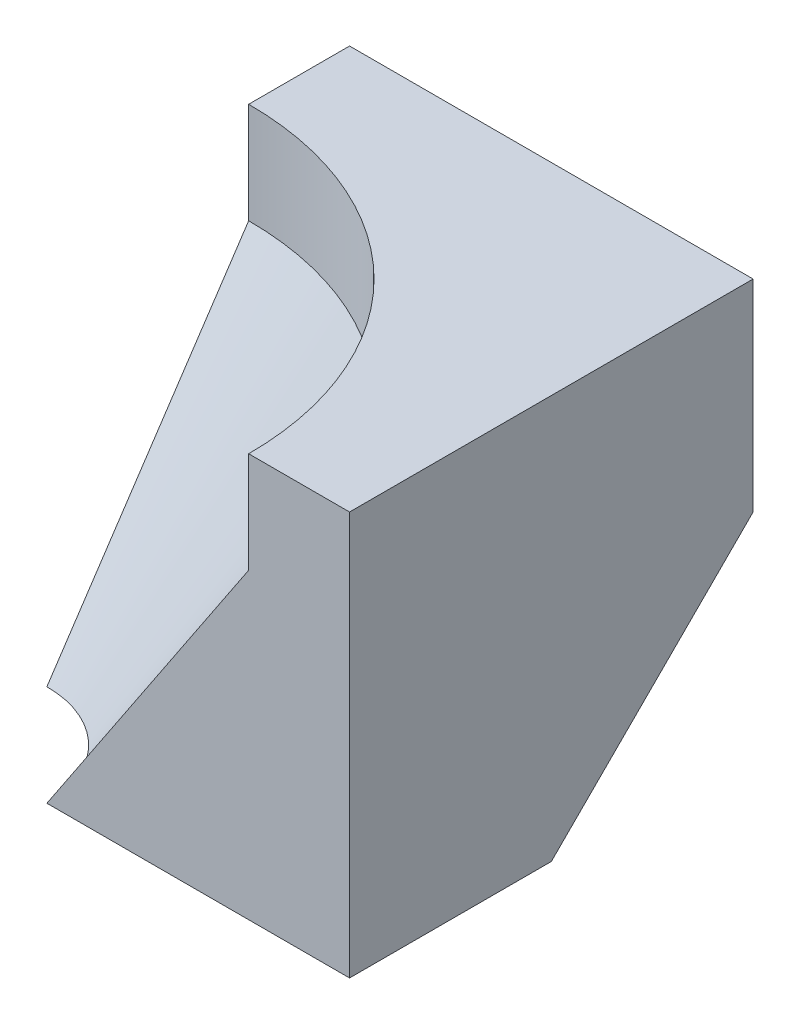
ISO-10303-21;
HEADER;
FILE_DESCRIPTION(('STEP AP214'),'2;1');
FILE_NAME('part.step','',(''),(''),'','','');
FILE_SCHEMA(('AUTOMOTIVE_DESIGN { 1 0 10303 214 1 1 1 1 }'));
ENDSEC;
DATA;
#1=APPLICATION_CONTEXT('core data for automotive mechanical design processes');
#2=APPLICATION_PROTOCOL_DEFINITION('international standard','automotive_design',2000,#1);
#3=PRODUCT_CONTEXT('',#1,'mechanical');
#4=PRODUCT('Part','Part','',(#3));
#5=PRODUCT_RELATED_PRODUCT_CATEGORY('part','',(#4));
#6=PRODUCT_DEFINITION_FORMATION('','',#4);
#7=PRODUCT_DEFINITION_CONTEXT('part definition',#1,'design');
#8=PRODUCT_DEFINITION('design','',#6,#7);
#9=PRODUCT_DEFINITION_SHAPE('','',#8);
#10=(LENGTH_UNIT() NAMED_UNIT(*) SI_UNIT(.MILLI.,.METRE.));
#11=(NAMED_UNIT(*) PLANE_ANGLE_UNIT() SI_UNIT($,.RADIAN.));
#12=(NAMED_UNIT(*) SI_UNIT($,.STERADIAN.) SOLID_ANGLE_UNIT());
#13=UNCERTAINTY_MEASURE_WITH_UNIT(LENGTH_MEASURE(1.E-05),#10,'distance_accuracy_value','');
#14=(GEOMETRIC_REPRESENTATION_CONTEXT(3) GLOBAL_UNCERTAINTY_ASSIGNED_CONTEXT((#13)) GLOBAL_UNIT_ASSIGNED_CONTEXT((#10,
#11,#12)) REPRESENTATION_CONTEXT('',''));
#15=CARTESIAN_POINT('',(0.,0.,0.));
#16=DIRECTION('',(0.,0.,1.));
#17=DIRECTION('',(1.,0.,0.));
#18=AXIS2_PLACEMENT_3D('',#15,#16,#17);
#19=CARTESIAN_POINT('',(0.,0.,40.));
#20=DIRECTION('',(0.,1.,0.));
#21=DIRECTION('',(0.,0.,1.));
#22=AXIS2_PLACEMENT_3D('',#19,#20,#21);
#23=PLANE('',#22);
#24=DIRECTION('',(1.,0.,0.));
#25=VECTOR('',#24,1.);
#26=CARTESIAN_POINT('',(0.,0.,40.));
#27=LINE('',#26,#25);
#28=CARTESIAN_POINT('',(10.,0.,40.));
#29=VERTEX_POINT('',#28);
#30=CARTESIAN_POINT('',(40.,0.,40.));
#31=VERTEX_POINT('',#30);
#32=EDGE_CURVE('E127',#29,#31,#27,.T.);
#33=ORIENTED_EDGE('',*,*,#32,.F.);
#34=CARTESIAN_POINT('',(0.,0.,40.));
#35=DIRECTION('',(0.,1.,0.));
#36=DIRECTION('',(0.,0.,1.));
#37=AXIS2_PLACEMENT_3D('',#34,#35,#36);
#38=CIRCLE('',#37,10.);
#39=CARTESIAN_POINT('',(0.,0.,30.));
#40=VERTEX_POINT('',#39);
#41=EDGE_CURVE('E104',#29,#40,#38,.T.);
#42=ORIENTED_EDGE('',*,*,#41,.T.);
#43=DIRECTION('',(0.,0.,-1.));
#44=VECTOR('',#43,1.);
#45=CARTESIAN_POINT('',(0.,0.,40.));
#46=LINE('',#45,#44);
#47=CARTESIAN_POINT('',(0.,0.,20.));
#48=VERTEX_POINT('',#47);
#49=EDGE_CURVE('E126',#40,#48,#46,.T.);
#50=ORIENTED_EDGE('',*,*,#49,.T.);
#51=DIRECTION('',(1.,0.,0.));
#52=VECTOR('',#51,1.);
#53=CARTESIAN_POINT('',(0.,0.,20.));
#54=LINE('',#53,#52);
#55=CARTESIAN_POINT('',(40.,0.,20.));
#56=VERTEX_POINT('',#55);
#57=EDGE_CURVE('E123',#48,#56,#54,.T.);
#58=ORIENTED_EDGE('',*,*,#57,.T.);
#59=DIRECTION('',(0.,0.,-1.));
#60=VECTOR('',#59,1.);
#61=CARTESIAN_POINT('',(40.,0.,40.));
#62=LINE('',#61,#60);
#63=EDGE_CURVE('E125',#31,#56,#62,.T.);
#64=ORIENTED_EDGE('',*,*,#63,.F.);
#65=EDGE_LOOP('',(#33,#42,#50,#58,#64));
#66=FACE_BOUND('',#65,.T.);
#67=ADVANCED_FACE('F33',(#66),#23,.F.);
#68=CARTESIAN_POINT('',(40.,0.,40.));
#69=DIRECTION('',(-1.,0.,0.));
#70=DIRECTION('',(0.,0.,1.));
#71=AXIS2_PLACEMENT_3D('',#68,#69,#70);
#72=PLANE('',#71);
#73=ORIENTED_EDGE('',*,*,#63,.T.);
#74=DIRECTION('',(0.,-0.707106781186548,0.707106781186548));
#75=VECTOR('',#74,1.);
#76=CARTESIAN_POINT('',(40.,20.,0.));
#77=LINE('',#76,#75);
#78=CARTESIAN_POINT('',(40.,20.,0.));
#79=VERTEX_POINT('',#78);
#80=EDGE_CURVE('E111',#79,#56,#77,.T.);
#81=ORIENTED_EDGE('',*,*,#80,.F.);
#82=DIRECTION('',(0.,1.,0.));
#83=VECTOR('',#82,1.);
#84=CARTESIAN_POINT('',(40.,0.,0.));
#85=LINE('',#84,#83);
#86=CARTESIAN_POINT('',(40.,40.,0.));
#87=VERTEX_POINT('',#86);
#88=EDGE_CURVE('E133',#79,#87,#85,.T.);
#89=ORIENTED_EDGE('',*,*,#88,.T.);
#90=DIRECTION('',(0.,0.,-1.));
#91=VECTOR('',#90,1.);
#92=CARTESIAN_POINT('',(40.,40.,40.));
#93=LINE('',#92,#91);
#94=CARTESIAN_POINT('',(40.,40.,40.));
#95=VERTEX_POINT('',#94);
#96=EDGE_CURVE('E120',#95,#87,#93,.T.);
#97=ORIENTED_EDGE('',*,*,#96,.F.);
#98=DIRECTION('',(0.,1.,0.));
#99=VECTOR('',#98,1.);
#100=CARTESIAN_POINT('',(40.,0.,40.));
#101=LINE('',#100,#99);
#102=EDGE_CURVE('E51',#31,#95,#101,.T.);
#103=ORIENTED_EDGE('',*,*,#102,.F.);
#104=EDGE_LOOP('',(#73,#81,#89,#97,#103));
#105=FACE_BOUND('',#104,.T.);
#106=ADVANCED_FACE('F155',(#105),#72,.F.);
#107=CARTESIAN_POINT('',(0.,0.,0.));
#108=DIRECTION('',(0.,0.,-1.));
#109=DIRECTION('',(-1.,0.,0.));
#110=AXIS2_PLACEMENT_3D('',#107,#108,#109);
#111=PLANE('',#110);
#112=DIRECTION('',(-1.,0.,0.));
#113=VECTOR('',#112,1.);
#114=CARTESIAN_POINT('',(0.,20.,0.));
#115=LINE('',#114,#113);
#116=CARTESIAN_POINT('',(0.,20.,0.));
#117=VERTEX_POINT('',#116);
#118=EDGE_CURVE('E37',#79,#117,#115,.T.);
#119=ORIENTED_EDGE('',*,*,#118,.T.);
#120=DIRECTION('',(0.,-1.,0.));
#121=VECTOR('',#120,1.);
#122=CARTESIAN_POINT('',(0.,0.,0.));
#123=LINE('',#122,#121);
#124=CARTESIAN_POINT('',(0.,40.,0.));
#125=VERTEX_POINT('',#124);
#126=EDGE_CURVE('E121',#125,#117,#123,.T.);
#127=ORIENTED_EDGE('',*,*,#126,.F.);
#128=DIRECTION('',(-1.,0.,0.));
#129=VECTOR('',#128,1.);
#130=CARTESIAN_POINT('',(0.,40.,0.));
#131=LINE('',#130,#129);
#132=EDGE_CURVE('E129',#87,#125,#131,.T.);
#133=ORIENTED_EDGE('',*,*,#132,.F.);
#134=ORIENTED_EDGE('',*,*,#88,.F.);
#135=EDGE_LOOP('',(#119,#127,#133,#134));
#136=FACE_BOUND('',#135,.T.);
#137=ADVANCED_FACE('F161',(#136),#111,.T.);
#138=CARTESIAN_POINT('',(0.,20.,0.));
#139=DIRECTION('',(0.,0.707106781186548,0.707106781186548));
#140=DIRECTION('',(0.,-0.707106781186548,0.707106781186548));
#141=AXIS2_PLACEMENT_3D('',#138,#139,#140);
#142=PLANE('',#141);
#143=DIRECTION('',(0.,-0.707106781186548,0.707106781186548));
#144=VECTOR('',#143,1.);
#145=CARTESIAN_POINT('',(0.,20.,0.));
#146=LINE('',#145,#144);
#147=EDGE_CURVE('E118',#117,#48,#146,.T.);
#148=ORIENTED_EDGE('',*,*,#147,.F.);
#149=ORIENTED_EDGE('',*,*,#118,.F.);
#150=ORIENTED_EDGE('',*,*,#80,.T.);
#151=ORIENTED_EDGE('',*,*,#57,.F.);
#152=EDGE_LOOP('',(#148,#149,#150,#151));
#153=FACE_BOUND('',#152,.T.);
#154=ADVANCED_FACE('F152',(#153),#142,.F.);
#155=CARTESIAN_POINT('',(0.,30.,40.));
#156=DIRECTION('',(0.,1.,0.));
#157=DIRECTION('',(0.,0.,1.));
#158=AXIS2_PLACEMENT_3D('',#155,#156,#157);
#159=CYLINDRICAL_SURFACE('',#158,30.);
#160=DIRECTION('',(0.,1.,0.));
#161=VECTOR('',#160,1.);
#162=CARTESIAN_POINT('',(0.,30.,10.));
#163=LINE('',#162,#161);
#164=CARTESIAN_POINT('',(0.,30.,10.));
#165=VERTEX_POINT('',#164);
#166=CARTESIAN_POINT('',(0.,40.,10.));
#167=VERTEX_POINT('',#166);
#168=EDGE_CURVE('E108',#165,#167,#163,.T.);
#169=ORIENTED_EDGE('',*,*,#168,.F.);
#170=CARTESIAN_POINT('',(0.,30.,40.));
#171=DIRECTION('',(0.,1.,0.));
#172=DIRECTION('',(0.,0.,1.));
#173=AXIS2_PLACEMENT_3D('',#170,#171,#172);
#174=CIRCLE('',#173,30.);
#175=CARTESIAN_POINT('',(30.,30.,40.));
#176=VERTEX_POINT('',#175);
#177=EDGE_CURVE('E11',#176,#165,#174,.T.);
#178=ORIENTED_EDGE('',*,*,#177,.F.);
#179=DIRECTION('',(0.,1.,0.));
#180=VECTOR('',#179,1.);
#181=CARTESIAN_POINT('',(30.,30.,40.));
#182=LINE('',#181,#180);
#183=CARTESIAN_POINT('',(30.,40.,40.));
#184=VERTEX_POINT('',#183);
#185=EDGE_CURVE('E75',#176,#184,#182,.T.);
#186=ORIENTED_EDGE('',*,*,#185,.T.);
#187=CARTESIAN_POINT('',(0.,40.,40.));
#188=DIRECTION('',(0.,1.,0.));
#189=DIRECTION('',(0.,0.,1.));
#190=AXIS2_PLACEMENT_3D('',#187,#188,#189);
#191=CIRCLE('',#190,30.);
#192=EDGE_CURVE('E78',#184,#167,#191,.T.);
#193=ORIENTED_EDGE('',*,*,#192,.T.);
#194=EDGE_LOOP('',(#169,#178,#186,#193));
#195=FACE_BOUND('',#194,.T.);
#196=ADVANCED_FACE('F35',(#195),#159,.F.);
#197=CARTESIAN_POINT('',(0.,0.,40.));
#198=DIRECTION('',(1.,0.,0.));
#199=DIRECTION('',(0.,0.,-1.));
#200=AXIS2_PLACEMENT_3D('',#197,#198,#199);
#201=PLANE('',#200);
#202=ORIENTED_EDGE('',*,*,#49,.F.);
#203=DIRECTION('',(0.,-0.832050294337844,0.554700196225229));
#204=VECTOR('',#203,1.);
#205=CARTESIAN_POINT('',(0.,0.,30.));
#206=LINE('',#205,#204);
#207=EDGE_CURVE('E106',#165,#40,#206,.T.);
#208=ORIENTED_EDGE('',*,*,#207,.F.);
#209=ORIENTED_EDGE('',*,*,#168,.T.);
#210=DIRECTION('',(0.,0.,-1.));
#211=VECTOR('',#210,1.);
#212=CARTESIAN_POINT('',(0.,40.,40.));
#213=LINE('',#212,#211);
#214=EDGE_CURVE('E84',#167,#125,#213,.T.);
#215=ORIENTED_EDGE('',*,*,#214,.T.);
#216=ORIENTED_EDGE('',*,*,#126,.T.);
#217=ORIENTED_EDGE('',*,*,#147,.T.);
#218=EDGE_LOOP('',(#202,#208,#209,#215,#216,#217));
#219=FACE_BOUND('',#218,.T.);
#220=ADVANCED_FACE('F148',(#219),#201,.F.);
#221=CARTESIAN_POINT('',(0.,40.,40.));
#222=DIRECTION('',(0.,-1.,0.));
#223=DIRECTION('',(0.,0.,-1.));
#224=AXIS2_PLACEMENT_3D('',#221,#222,#223);
#225=PLANE('',#224);
#226=ORIENTED_EDGE('',*,*,#214,.F.);
#227=ORIENTED_EDGE('',*,*,#192,.F.);
#228=DIRECTION('',(-1.,0.,0.));
#229=VECTOR('',#228,1.);
#230=CARTESIAN_POINT('',(0.,40.,40.));
#231=LINE('',#230,#229);
#232=EDGE_CURVE('E43',#95,#184,#231,.T.);
#233=ORIENTED_EDGE('',*,*,#232,.F.);
#234=ORIENTED_EDGE('',*,*,#96,.T.);
#235=ORIENTED_EDGE('',*,*,#132,.T.);
#236=EDGE_LOOP('',(#226,#227,#233,#234,#235));
#237=FACE_BOUND('',#236,.T.);
#238=ADVANCED_FACE('F159',(#237),#225,.F.);
#239=CARTESIAN_POINT('',(0.,0.,40.));
#240=DIRECTION('',(0.,0.,-1.));
#241=DIRECTION('',(-1.,0.,0.));
#242=AXIS2_PLACEMENT_3D('',#239,#240,#241);
#243=PLANE('',#242);
#244=ORIENTED_EDGE('',*,*,#185,.F.);
#245=DIRECTION('',(0.554700196225229,0.832050294337844,0.));
#246=VECTOR('',#245,1.);
#247=CARTESIAN_POINT('',(30.,30.,40.));
#248=LINE('',#247,#246);
#249=EDGE_CURVE('E100',#29,#176,#248,.T.);
#250=ORIENTED_EDGE('',*,*,#249,.F.);
#251=ORIENTED_EDGE('',*,*,#32,.T.);
#252=ORIENTED_EDGE('',*,*,#102,.T.);
#253=ORIENTED_EDGE('',*,*,#232,.T.);
#254=EDGE_LOOP('',(#244,#250,#251,#252,#253));
#255=FACE_BOUND('',#254,.T.);
#256=ADVANCED_FACE('F109',(#255),#243,.F.);
#257=CARTESIAN_POINT('',(0.,0.,40.));
#258=DIRECTION('',(0.,1.,0.));
#259=DIRECTION('',(-1.,0.,0.));
#260=AXIS2_PLACEMENT_3D('',#257,#258,#259);
#261=CONICAL_SURFACE('',#260,10.,0.588002603547567);
#262=ORIENTED_EDGE('',*,*,#41,.F.);
#263=ORIENTED_EDGE('',*,*,#249,.T.);
#264=ORIENTED_EDGE('',*,*,#177,.T.);
#265=ORIENTED_EDGE('',*,*,#207,.T.);
#266=EDGE_LOOP('',(#262,#263,#264,#265));
#267=FACE_BOUND('',#266,.T.);
#268=ADVANCED_FACE('F101',(#267),#261,.F.);
#269=CLOSED_SHELL('',(#67,#106,#137,#154,#196,#220,#238,#256,#268));
#270=MANIFOLD_SOLID_BREP('B2',#269);
#271=ADVANCED_BREP_SHAPE_REPRESENTATION('',(#18,#270),#14);
#272=SHAPE_DEFINITION_REPRESENTATION(#9,#271);
ENDSEC;
END-ISO-10303-21;
